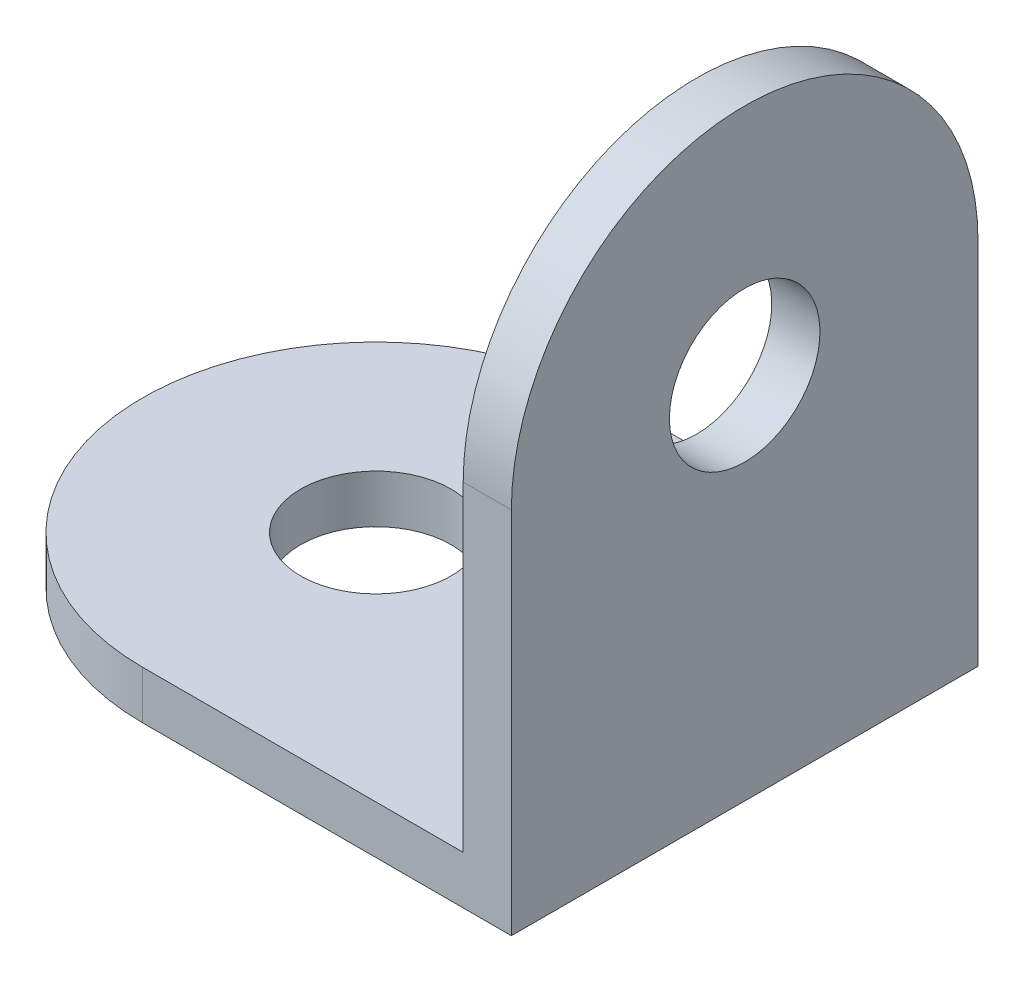
ISO-10303-21;
HEADER;
FILE_DESCRIPTION(('STEP AP214'),'2;1');
FILE_NAME('part.step','',(''),(''),'','','');
FILE_SCHEMA(('AUTOMOTIVE_DESIGN { 1 0 10303 214 1 1 1 1 }'));
ENDSEC;
DATA;
#1=APPLICATION_CONTEXT('core data for automotive mechanical design processes');
#2=APPLICATION_PROTOCOL_DEFINITION('international standard','automotive_design',2000,#1);
#3=PRODUCT_CONTEXT('',#1,'mechanical');
#4=PRODUCT('Part','Part','',(#3));
#5=PRODUCT_RELATED_PRODUCT_CATEGORY('part','',(#4));
#6=PRODUCT_DEFINITION_FORMATION('','',#4);
#7=PRODUCT_DEFINITION_CONTEXT('part definition',#1,'design');
#8=PRODUCT_DEFINITION('design','',#6,#7);
#9=PRODUCT_DEFINITION_SHAPE('','',#8);
#10=(LENGTH_UNIT() NAMED_UNIT(*) SI_UNIT(.MILLI.,.METRE.));
#11=(NAMED_UNIT(*) PLANE_ANGLE_UNIT() SI_UNIT($,.RADIAN.));
#12=(NAMED_UNIT(*) SI_UNIT($,.STERADIAN.) SOLID_ANGLE_UNIT());
#13=UNCERTAINTY_MEASURE_WITH_UNIT(LENGTH_MEASURE(1.E-05),#10,'distance_accuracy_value','');
#14=(GEOMETRIC_REPRESENTATION_CONTEXT(3) GLOBAL_UNCERTAINTY_ASSIGNED_CONTEXT((#13)) GLOBAL_UNIT_ASSIGNED_CONTEXT((#10,
#11,#12)) REPRESENTATION_CONTEXT('',''));
#15=CARTESIAN_POINT('',(0.,0.,0.));
#16=DIRECTION('',(0.,0.,1.));
#17=DIRECTION('',(1.,0.,0.));
#18=AXIS2_PLACEMENT_3D('',#15,#16,#17);
#19=CARTESIAN_POINT('',(-1.6,1.6,15.5));
#20=DIRECTION('',(0.,-1.,0.));
#21=DIRECTION('',(1.,0.,0.));
#22=AXIS2_PLACEMENT_3D('',#19,#20,#21);
#23=PLANE('',#22);
#24=CARTESIAN_POINT('',(-12.25,1.6,7.75));
#25=DIRECTION('',(0.,1.,0.));
#26=DIRECTION('',(-1.,0.,0.));
#27=AXIS2_PLACEMENT_3D('',#24,#25,#26);
#28=CIRCLE('',#27,2.5);
#29=CARTESIAN_POINT('',(-14.75,1.6,7.75));
#30=VERTEX_POINT('',#29);
#31=EDGE_CURVE('E142',#30,#30,#28,.T.);
#32=ORIENTED_EDGE('',*,*,#31,.F.);
#33=EDGE_LOOP('',(#32));
#34=FACE_BOUND('',#33,.T.);
#35=DIRECTION('',(-1.,0.,0.));
#36=VECTOR('',#35,1.);
#37=CARTESIAN_POINT('',(-1.6,1.6,0.));
#38=LINE('',#37,#36);
#39=CARTESIAN_POINT('',(-1.6,1.6,0.));
#40=VERTEX_POINT('',#39);
#41=CARTESIAN_POINT('',(-12.25,1.6,0.));
#42=VERTEX_POINT('',#41);
#43=EDGE_CURVE('E85',#40,#42,#38,.T.);
#44=ORIENTED_EDGE('',*,*,#43,.T.);
#45=CARTESIAN_POINT('',(-12.25,1.6,7.75));
#46=DIRECTION('',(0.,1.,0.));
#47=DIRECTION('',(-1.,0.,0.));
#48=AXIS2_PLACEMENT_3D('',#45,#46,#47);
#49=CIRCLE('',#48,7.75);
#50=CARTESIAN_POINT('',(-12.25,1.6,15.5));
#51=VERTEX_POINT('',#50);
#52=EDGE_CURVE('E131',#42,#51,#49,.T.);
#53=ORIENTED_EDGE('',*,*,#52,.T.);
#54=DIRECTION('',(-1.,0.,0.));
#55=VECTOR('',#54,1.);
#56=CARTESIAN_POINT('',(-1.6,1.6,15.5));
#57=LINE('',#56,#55);
#58=CARTESIAN_POINT('',(-1.6,1.6,15.5));
#59=VERTEX_POINT('',#58);
#60=EDGE_CURVE('E123',#59,#51,#57,.T.);
#61=ORIENTED_EDGE('',*,*,#60,.F.);
#62=DIRECTION('',(0.,0.,-1.));
#63=VECTOR('',#62,1.);
#64=CARTESIAN_POINT('',(-1.6,1.6,15.5));
#65=LINE('',#64,#63);
#66=EDGE_CURVE('E90',#59,#40,#65,.T.);
#67=ORIENTED_EDGE('',*,*,#66,.T.);
#68=EDGE_LOOP('',(#44,#53,#61,#67));
#69=FACE_BOUND('',#68,.T.);
#70=ADVANCED_FACE('F35',(#34,#69),#23,.F.);
#71=CARTESIAN_POINT('',(0.,0.,15.5));
#72=DIRECTION('',(0.,1.,0.));
#73=DIRECTION('',(-1.,0.,0.));
#74=AXIS2_PLACEMENT_3D('',#71,#72,#73);
#75=PLANE('',#74);
#76=CARTESIAN_POINT('',(-12.25,0.,7.75));
#77=DIRECTION('',(0.,1.,0.));
#78=DIRECTION('',(-1.,0.,0.));
#79=AXIS2_PLACEMENT_3D('',#76,#77,#78);
#80=CIRCLE('',#79,2.5);
#81=CARTESIAN_POINT('',(-14.75,0.,7.75));
#82=VERTEX_POINT('',#81);
#83=EDGE_CURVE('E39',#82,#82,#80,.T.);
#84=ORIENTED_EDGE('',*,*,#83,.T.);
#85=EDGE_LOOP('',(#84));
#86=FACE_BOUND('',#85,.T.);
#87=CARTESIAN_POINT('',(-12.25,0.,7.75));
#88=DIRECTION('',(0.,1.,0.));
#89=DIRECTION('',(-1.,0.,0.));
#90=AXIS2_PLACEMENT_3D('',#87,#88,#89);
#91=CIRCLE('',#90,7.75);
#92=CARTESIAN_POINT('',(-12.25,0.,0.));
#93=VERTEX_POINT('',#92);
#94=CARTESIAN_POINT('',(-12.25,0.,15.5));
#95=VERTEX_POINT('',#94);
#96=EDGE_CURVE('E11',#93,#95,#91,.T.);
#97=ORIENTED_EDGE('',*,*,#96,.F.);
#98=DIRECTION('',(1.,0.,0.));
#99=VECTOR('',#98,1.);
#100=CARTESIAN_POINT('',(0.,0.,0.));
#101=LINE('',#100,#99);
#102=CARTESIAN_POINT('',(0.,0.,0.));
#103=VERTEX_POINT('',#102);
#104=EDGE_CURVE('E74',#93,#103,#101,.T.);
#105=ORIENTED_EDGE('',*,*,#104,.T.);
#106=DIRECTION('',(0.,0.,-1.));
#107=VECTOR('',#106,1.);
#108=CARTESIAN_POINT('',(0.,0.,15.5));
#109=LINE('',#108,#107);
#110=CARTESIAN_POINT('',(0.,0.,15.5));
#111=VERTEX_POINT('',#110);
#112=EDGE_CURVE('E77',#111,#103,#109,.T.);
#113=ORIENTED_EDGE('',*,*,#112,.F.);
#114=DIRECTION('',(1.,0.,0.));
#115=VECTOR('',#114,1.);
#116=CARTESIAN_POINT('',(0.,0.,15.5));
#117=LINE('',#116,#115);
#118=EDGE_CURVE('E60',#95,#111,#117,.T.);
#119=ORIENTED_EDGE('',*,*,#118,.F.);
#120=EDGE_LOOP('',(#97,#105,#113,#119));
#121=FACE_BOUND('',#120,.T.);
#122=ADVANCED_FACE('F76',(#86,#121),#75,.F.);
#123=CARTESIAN_POINT('',(0.,0.,15.5));
#124=DIRECTION('',(-1.,0.,0.));
#125=DIRECTION('',(0.,0.,1.));
#126=AXIS2_PLACEMENT_3D('',#123,#124,#125);
#127=PLANE('',#126);
#128=CARTESIAN_POINT('',(0.,12.25,7.75));
#129=DIRECTION('',(-1.,0.,0.));
#130=DIRECTION('',(0.,0.,1.));
#131=AXIS2_PLACEMENT_3D('',#128,#129,#130);
#132=CIRCLE('',#131,2.5);
#133=CARTESIAN_POINT('',(0.,12.25,10.25));
#134=VERTEX_POINT('',#133);
#135=EDGE_CURVE('E136',#134,#134,#132,.T.);
#136=ORIENTED_EDGE('',*,*,#135,.T.);
#137=EDGE_LOOP('',(#136));
#138=FACE_BOUND('',#137,.T.);
#139=CARTESIAN_POINT('',(0.,12.25,7.75));
#140=DIRECTION('',(-1.,0.,0.));
#141=DIRECTION('',(0.,0.,1.));
#142=AXIS2_PLACEMENT_3D('',#139,#140,#141);
#143=CIRCLE('',#142,7.75);
#144=CARTESIAN_POINT('',(0.,12.25,15.5));
#145=VERTEX_POINT('',#144);
#146=CARTESIAN_POINT('',(0.,12.25,0.));
#147=VERTEX_POINT('',#146);
#148=EDGE_CURVE('E51',#145,#147,#143,.T.);
#149=ORIENTED_EDGE('',*,*,#148,.F.);
#150=DIRECTION('',(0.,1.,0.));
#151=VECTOR('',#150,1.);
#152=CARTESIAN_POINT('',(0.,0.,15.5));
#153=LINE('',#152,#151);
#154=EDGE_CURVE('E84',#111,#145,#153,.T.);
#155=ORIENTED_EDGE('',*,*,#154,.F.);
#156=ORIENTED_EDGE('',*,*,#112,.T.);
#157=DIRECTION('',(0.,1.,0.));
#158=VECTOR('',#157,1.);
#159=CARTESIAN_POINT('',(0.,0.,0.));
#160=LINE('',#159,#158);
#161=EDGE_CURVE('E89',#103,#147,#160,.T.);
#162=ORIENTED_EDGE('',*,*,#161,.T.);
#163=EDGE_LOOP('',(#149,#155,#156,#162));
#164=FACE_BOUND('',#163,.T.);
#165=ADVANCED_FACE('F37',(#138,#164),#127,.F.);
#166=CARTESIAN_POINT('',(-1.6,20.,15.5));
#167=DIRECTION('',(1.,0.,0.));
#168=DIRECTION('',(0.,1.,0.));
#169=AXIS2_PLACEMENT_3D('',#166,#167,#168);
#170=PLANE('',#169);
#171=CARTESIAN_POINT('',(-1.6,12.25,7.75));
#172=DIRECTION('',(-1.,0.,0.));
#173=DIRECTION('',(0.,-1.,0.));
#174=AXIS2_PLACEMENT_3D('',#171,#172,#173);
#175=CIRCLE('',#174,2.5);
#176=CARTESIAN_POINT('',(-1.6,9.75,7.75));
#177=VERTEX_POINT('',#176);
#178=EDGE_CURVE('E139',#177,#177,#175,.T.);
#179=ORIENTED_EDGE('',*,*,#178,.F.);
#180=EDGE_LOOP('',(#179));
#181=FACE_BOUND('',#180,.T.);
#182=DIRECTION('',(0.,-1.,0.));
#183=VECTOR('',#182,1.);
#184=CARTESIAN_POINT('',(-1.6,20.,15.5));
#185=LINE('',#184,#183);
#186=CARTESIAN_POINT('',(-1.6,12.25,15.5));
#187=VERTEX_POINT('',#186);
#188=EDGE_CURVE('E113',#187,#59,#185,.T.);
#189=ORIENTED_EDGE('',*,*,#188,.F.);
#190=CARTESIAN_POINT('',(-1.6,12.25,7.75));
#191=DIRECTION('',(-1.,0.,0.));
#192=DIRECTION('',(0.,-1.,0.));
#193=AXIS2_PLACEMENT_3D('',#190,#191,#192);
#194=CIRCLE('',#193,7.75);
#195=CARTESIAN_POINT('',(-1.6,12.25,0.));
#196=VERTEX_POINT('',#195);
#197=EDGE_CURVE('E98',#187,#196,#194,.T.);
#198=ORIENTED_EDGE('',*,*,#197,.T.);
#199=DIRECTION('',(0.,-1.,0.));
#200=VECTOR('',#199,1.);
#201=CARTESIAN_POINT('',(-1.6,20.,0.));
#202=LINE('',#201,#200);
#203=EDGE_CURVE('E95',#196,#40,#202,.T.);
#204=ORIENTED_EDGE('',*,*,#203,.T.);
#205=ORIENTED_EDGE('',*,*,#66,.F.);
#206=EDGE_LOOP('',(#189,#198,#204,#205));
#207=FACE_BOUND('',#206,.T.);
#208=ADVANCED_FACE('F121',(#181,#207),#170,.F.);
#209=CARTESIAN_POINT('',(0.,0.,15.5));
#210=DIRECTION('',(0.,0.,1.));
#211=DIRECTION('',(1.,0.,0.));
#212=AXIS2_PLACEMENT_3D('',#209,#210,#211);
#213=PLANE('',#212);
#214=DIRECTION('',(0.,1.,0.));
#215=VECTOR('',#214,1.);
#216=CARTESIAN_POINT('',(-12.25,-13.9,15.5));
#217=LINE('',#216,#215);
#218=EDGE_CURVE('E128',#95,#51,#217,.T.);
#219=ORIENTED_EDGE('',*,*,#218,.F.);
#220=ORIENTED_EDGE('',*,*,#118,.T.);
#221=ORIENTED_EDGE('',*,*,#154,.T.);
#222=DIRECTION('',(-1.,0.,0.));
#223=VECTOR('',#222,1.);
#224=CARTESIAN_POINT('',(13.9,12.25,15.5));
#225=LINE('',#224,#223);
#226=EDGE_CURVE('E44',#145,#187,#225,.T.);
#227=ORIENTED_EDGE('',*,*,#226,.T.);
#228=ORIENTED_EDGE('',*,*,#188,.T.);
#229=ORIENTED_EDGE('',*,*,#60,.T.);
#230=EDGE_LOOP('',(#219,#220,#221,#227,#228,#229));
#231=FACE_BOUND('',#230,.T.);
#232=ADVANCED_FACE('F111',(#231),#213,.T.);
#233=CARTESIAN_POINT('',(0.,0.,0.));
#234=DIRECTION('',(0.,0.,1.));
#235=DIRECTION('',(1.,0.,0.));
#236=AXIS2_PLACEMENT_3D('',#233,#234,#235);
#237=PLANE('',#236);
#238=ORIENTED_EDGE('',*,*,#104,.F.);
#239=DIRECTION('',(0.,1.,0.));
#240=VECTOR('',#239,1.);
#241=CARTESIAN_POINT('',(-12.25,-13.9,0.));
#242=LINE('',#241,#240);
#243=EDGE_CURVE('E134',#93,#42,#242,.T.);
#244=ORIENTED_EDGE('',*,*,#243,.T.);
#245=ORIENTED_EDGE('',*,*,#43,.F.);
#246=ORIENTED_EDGE('',*,*,#203,.F.);
#247=DIRECTION('',(-1.,0.,0.));
#248=VECTOR('',#247,1.);
#249=CARTESIAN_POINT('',(13.9,12.25,0.));
#250=LINE('',#249,#248);
#251=EDGE_CURVE('E94',#147,#196,#250,.T.);
#252=ORIENTED_EDGE('',*,*,#251,.F.);
#253=ORIENTED_EDGE('',*,*,#161,.F.);
#254=EDGE_LOOP('',(#238,#244,#245,#246,#252,#253));
#255=FACE_BOUND('',#254,.T.);
#256=ADVANCED_FACE('F92',(#255),#237,.F.);
#257=CARTESIAN_POINT('',(13.9,12.25,7.75));
#258=DIRECTION('',(-1.,0.,0.));
#259=DIRECTION('',(0.,-1.,0.));
#260=AXIS2_PLACEMENT_3D('',#257,#258,#259);
#261=CYLINDRICAL_SURFACE('',#260,7.75);
#262=ORIENTED_EDGE('',*,*,#148,.T.);
#263=ORIENTED_EDGE('',*,*,#251,.T.);
#264=ORIENTED_EDGE('',*,*,#197,.F.);
#265=ORIENTED_EDGE('',*,*,#226,.F.);
#266=EDGE_LOOP('',(#262,#263,#264,#265));
#267=FACE_BOUND('',#266,.T.);
#268=ADVANCED_FACE('F208',(#267),#261,.T.);
#269=CARTESIAN_POINT('',(-12.25,-13.9,7.75));
#270=DIRECTION('',(0.,1.,0.));
#271=DIRECTION('',(-1.,0.,0.));
#272=AXIS2_PLACEMENT_3D('',#269,#270,#271);
#273=CYLINDRICAL_SURFACE('',#272,7.75);
#274=ORIENTED_EDGE('',*,*,#96,.T.);
#275=ORIENTED_EDGE('',*,*,#218,.T.);
#276=ORIENTED_EDGE('',*,*,#52,.F.);
#277=ORIENTED_EDGE('',*,*,#243,.F.);
#278=EDGE_LOOP('',(#274,#275,#276,#277));
#279=FACE_BOUND('',#278,.T.);
#280=ADVANCED_FACE('F157',(#279),#273,.T.);
#281=CARTESIAN_POINT('',(13.9,12.25,7.75));
#282=DIRECTION('',(-1.,0.,0.));
#283=DIRECTION('',(0.,-1.,0.));
#284=AXIS2_PLACEMENT_3D('',#281,#282,#283);
#285=CYLINDRICAL_SURFACE('',#284,2.5);
#286=ORIENTED_EDGE('',*,*,#178,.T.);
#287=EDGE_LOOP('',(#286));
#288=FACE_BOUND('',#287,.T.);
#289=ORIENTED_EDGE('',*,*,#135,.F.);
#290=EDGE_LOOP('',(#289));
#291=FACE_BOUND('',#290,.T.);
#292=ADVANCED_FACE('F152',(#288,#291),#285,.F.);
#293=CARTESIAN_POINT('',(-12.25,-13.9,7.75));
#294=DIRECTION('',(0.,1.,0.));
#295=DIRECTION('',(-1.,0.,0.));
#296=AXIS2_PLACEMENT_3D('',#293,#294,#295);
#297=CYLINDRICAL_SURFACE('',#296,2.5);
#298=ORIENTED_EDGE('',*,*,#31,.T.);
#299=EDGE_LOOP('',(#298));
#300=FACE_BOUND('',#299,.T.);
#301=ORIENTED_EDGE('',*,*,#83,.F.);
#302=EDGE_LOOP('',(#301));
#303=FACE_BOUND('',#302,.T.);
#304=ADVANCED_FACE('F150',(#300,#303),#297,.F.);
#305=CLOSED_SHELL('',(#70,#122,#165,#208,#232,#256,#268,#280,#292,#304));
#306=MANIFOLD_SOLID_BREP('B2',#305);
#307=ADVANCED_BREP_SHAPE_REPRESENTATION('',(#18,#306),#14);
#308=SHAPE_DEFINITION_REPRESENTATION(#9,#307);
ENDSEC;
END-ISO-10303-21;
